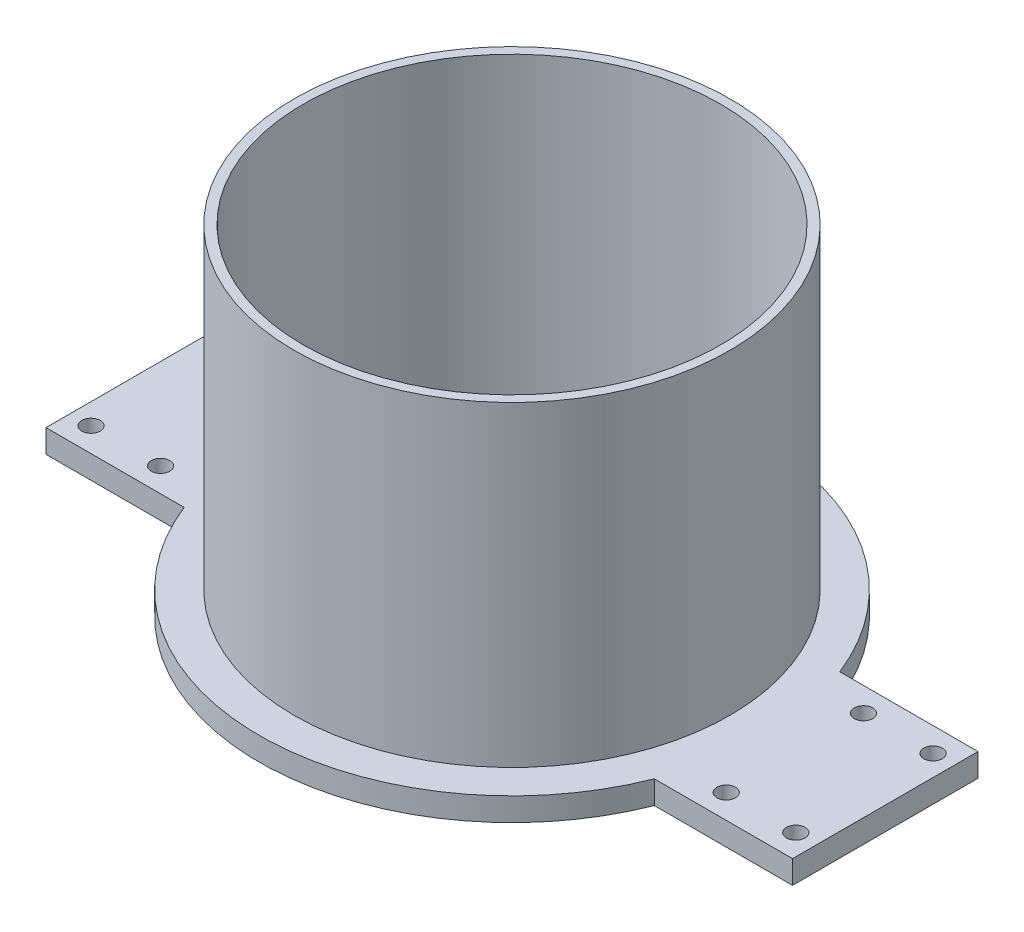
ISO-10303-21;
HEADER;
FILE_DESCRIPTION(('STEP AP214'),'2;1');
FILE_NAME('part.step','',(''),(''),'','','');
FILE_SCHEMA(('AUTOMOTIVE_DESIGN { 1 0 10303 214 1 1 1 1 }'));
ENDSEC;
DATA;
#1=APPLICATION_CONTEXT('core data for automotive mechanical design processes');
#2=APPLICATION_PROTOCOL_DEFINITION('international standard','automotive_design',2000,#1);
#3=PRODUCT_CONTEXT('',#1,'mechanical');
#4=PRODUCT('Part','Part','',(#3));
#5=PRODUCT_RELATED_PRODUCT_CATEGORY('part','',(#4));
#6=PRODUCT_DEFINITION_FORMATION('','',#4);
#7=PRODUCT_DEFINITION_CONTEXT('part definition',#1,'design');
#8=PRODUCT_DEFINITION('design','',#6,#7);
#9=PRODUCT_DEFINITION_SHAPE('','',#8);
#10=(LENGTH_UNIT() NAMED_UNIT(*) SI_UNIT(.MILLI.,.METRE.));
#11=(NAMED_UNIT(*) PLANE_ANGLE_UNIT() SI_UNIT($,.RADIAN.));
#12=(NAMED_UNIT(*) SI_UNIT($,.STERADIAN.) SOLID_ANGLE_UNIT());
#13=UNCERTAINTY_MEASURE_WITH_UNIT(LENGTH_MEASURE(1.E-05),#10,'distance_accuracy_value','');
#14=(GEOMETRIC_REPRESENTATION_CONTEXT(3) GLOBAL_UNCERTAINTY_ASSIGNED_CONTEXT((#13)) GLOBAL_UNIT_ASSIGNED_CONTEXT((#10,
#11,#12)) REPRESENTATION_CONTEXT('',''));
#15=CARTESIAN_POINT('',(0.,0.,0.));
#16=DIRECTION('',(0.,0.,1.));
#17=DIRECTION('',(1.,0.,0.));
#18=AXIS2_PLACEMENT_3D('',#15,#16,#17);
#19=CARTESIAN_POINT('',(0.,5.,0.));
#20=DIRECTION('',(0.,1.,0.));
#21=DIRECTION('',(0.,0.,1.));
#22=AXIS2_PLACEMENT_3D('',#19,#20,#21);
#23=PLANE('',#22);
#24=CARTESIAN_POINT('',(-61.,5.,14.8));
#25=DIRECTION('',(0.,1.,0.));
#26=DIRECTION('',(0.,0.,-1.));
#27=AXIS2_PLACEMENT_3D('',#24,#25,#26);
#28=CIRCLE('',#27,2.);
#29=CARTESIAN_POINT('',(-61.,5.,12.8));
#30=VERTEX_POINT('',#29);
#31=EDGE_CURVE('E228',#30,#30,#28,.T.);
#32=ORIENTED_EDGE('',*,*,#31,.F.);
#33=EDGE_LOOP('',(#32));
#34=FACE_BOUND('',#33,.T.);
#35=CARTESIAN_POINT('',(-76.,5.,-14.8));
#36=DIRECTION('',(0.,1.,0.));
#37=DIRECTION('',(0.,0.,1.));
#38=AXIS2_PLACEMENT_3D('',#35,#36,#37);
#39=CIRCLE('',#38,2.);
#40=CARTESIAN_POINT('',(-76.,5.,-12.8));
#41=VERTEX_POINT('',#40);
#42=EDGE_CURVE('E216',#41,#41,#39,.T.);
#43=ORIENTED_EDGE('',*,*,#42,.F.);
#44=EDGE_LOOP('',(#43));
#45=FACE_BOUND('',#44,.T.);
#46=CARTESIAN_POINT('',(61.,5.,-14.8));
#47=DIRECTION('',(0.,1.,0.));
#48=DIRECTION('',(0.,0.,-1.));
#49=AXIS2_PLACEMENT_3D('',#46,#47,#48);
#50=CIRCLE('',#49,2.);
#51=CARTESIAN_POINT('',(61.,5.,-16.8));
#52=VERTEX_POINT('',#51);
#53=EDGE_CURVE('E204',#52,#52,#50,.T.);
#54=ORIENTED_EDGE('',*,*,#53,.F.);
#55=EDGE_LOOP('',(#54));
#56=FACE_BOUND('',#55,.T.);
#57=CARTESIAN_POINT('',(76.0000000000002,5.,14.8000000000001));
#58=DIRECTION('',(0.,1.,0.));
#59=DIRECTION('',(0.,0.,1.));
#60=AXIS2_PLACEMENT_3D('',#57,#58,#59);
#61=CIRCLE('',#60,2.00000000000001);
#62=CARTESIAN_POINT('',(76.0000000000002,5.,16.8000000000001));
#63=VERTEX_POINT('',#62);
#64=EDGE_CURVE('E192',#63,#63,#61,.T.);
#65=ORIENTED_EDGE('',*,*,#64,.F.);
#66=EDGE_LOOP('',(#65));
#67=FACE_BOUND('',#66,.T.);
#68=CARTESIAN_POINT('',(0.,5.,0.));
#69=DIRECTION('',(0.,1.,0.));
#70=DIRECTION('',(0.,0.,1.));
#71=AXIS2_PLACEMENT_3D('',#68,#69,#70);
#72=CIRCLE('',#71,54.5);
#73=CARTESIAN_POINT('',(50.6976330808451,5.,-20.));
#74=VERTEX_POINT('',#73);
#75=CARTESIAN_POINT('',(-50.6976330808451,5.,-20.));
#76=VERTEX_POINT('',#75);
#77=EDGE_CURVE('E152',#74,#76,#72,.T.);
#78=ORIENTED_EDGE('',*,*,#77,.T.);
#79=DIRECTION('',(-1.,0.,0.));
#80=VECTOR('',#79,1.);
#81=CARTESIAN_POINT('',(-50.6976330808451,5.,-20.));
#82=LINE('',#81,#80);
#83=CARTESIAN_POINT('',(-80.5,5.,-20.));
#84=VERTEX_POINT('',#83);
#85=EDGE_CURVE('E100',#76,#84,#82,.T.);
#86=ORIENTED_EDGE('',*,*,#85,.T.);
#87=DIRECTION('',(0.,0.,1.));
#88=VECTOR('',#87,1.);
#89=CARTESIAN_POINT('',(-80.5,5.,-20.));
#90=LINE('',#89,#88);
#91=CARTESIAN_POINT('',(-80.5,5.,20.));
#92=VERTEX_POINT('',#91);
#93=EDGE_CURVE('E167',#84,#92,#90,.T.);
#94=ORIENTED_EDGE('',*,*,#93,.T.);
#95=DIRECTION('',(1.,0.,0.));
#96=VECTOR('',#95,1.);
#97=CARTESIAN_POINT('',(-80.5,5.,20.));
#98=LINE('',#97,#96);
#99=CARTESIAN_POINT('',(-50.6976330808451,5.,19.9999999999999));
#100=VERTEX_POINT('',#99);
#101=EDGE_CURVE('E180',#92,#100,#98,.T.);
#102=ORIENTED_EDGE('',*,*,#101,.T.);
#103=CARTESIAN_POINT('',(0.,5.,0.));
#104=DIRECTION('',(0.,1.,0.));
#105=DIRECTION('',(0.,0.,1.));
#106=AXIS2_PLACEMENT_3D('',#103,#104,#105);
#107=CIRCLE('',#106,54.5);
#108=CARTESIAN_POINT('',(50.6976330808451,5.,20.));
#109=VERTEX_POINT('',#108);
#110=EDGE_CURVE('E119',#100,#109,#107,.T.);
#111=ORIENTED_EDGE('',*,*,#110,.T.);
#112=DIRECTION('',(1.,0.,0.));
#113=VECTOR('',#112,1.);
#114=CARTESIAN_POINT('',(80.5,5.,20.));
#115=LINE('',#114,#113);
#116=CARTESIAN_POINT('',(80.5,5.,20.));
#117=VERTEX_POINT('',#116);
#118=EDGE_CURVE('E113',#109,#117,#115,.T.);
#119=ORIENTED_EDGE('',*,*,#118,.T.);
#120=DIRECTION('',(0.,0.,-1.));
#121=VECTOR('',#120,1.);
#122=CARTESIAN_POINT('',(80.5,5.,-20.));
#123=LINE('',#122,#121);
#124=CARTESIAN_POINT('',(80.5,5.,-20.));
#125=VERTEX_POINT('',#124);
#126=EDGE_CURVE('E117',#117,#125,#123,.T.);
#127=ORIENTED_EDGE('',*,*,#126,.T.);
#128=DIRECTION('',(-1.,0.,0.));
#129=VECTOR('',#128,1.);
#130=CARTESIAN_POINT('',(50.6976330808451,5.,-20.));
#131=LINE('',#130,#129);
#132=EDGE_CURVE('E57',#125,#74,#131,.T.);
#133=ORIENTED_EDGE('',*,*,#132,.T.);
#134=EDGE_LOOP('',(#78,#86,#94,#102,#111,#119,#127,#133));
#135=FACE_BOUND('',#134,.T.);
#136=CARTESIAN_POINT('',(61.,5.,14.8));
#137=DIRECTION('',(0.,1.,0.));
#138=DIRECTION('',(0.,0.,1.));
#139=AXIS2_PLACEMENT_3D('',#136,#137,#138);
#140=CIRCLE('',#139,2.);
#141=CARTESIAN_POINT('',(61.,5.,16.8));
#142=VERTEX_POINT('',#141);
#143=EDGE_CURVE('E188',#142,#142,#140,.T.);
#144=ORIENTED_EDGE('',*,*,#143,.F.);
#145=EDGE_LOOP('',(#144));
#146=FACE_BOUND('',#145,.T.);
#147=CARTESIAN_POINT('',(76.,5.,-14.8));
#148=DIRECTION('',(0.,1.,0.));
#149=DIRECTION('',(0.,0.,-1.));
#150=AXIS2_PLACEMENT_3D('',#147,#148,#149);
#151=CIRCLE('',#150,2.);
#152=CARTESIAN_POINT('',(76.,5.,-16.8));
#153=VERTEX_POINT('',#152);
#154=EDGE_CURVE('E198',#153,#153,#151,.T.);
#155=ORIENTED_EDGE('',*,*,#154,.F.);
#156=EDGE_LOOP('',(#155));
#157=FACE_BOUND('',#156,.T.);
#158=CARTESIAN_POINT('',(-61.,5.,-14.8));
#159=DIRECTION('',(0.,1.,0.));
#160=DIRECTION('',(0.,0.,1.));
#161=AXIS2_PLACEMENT_3D('',#158,#159,#160);
#162=CIRCLE('',#161,2.);
#163=CARTESIAN_POINT('',(-61.,5.,-12.8));
#164=VERTEX_POINT('',#163);
#165=EDGE_CURVE('E210',#164,#164,#162,.T.);
#166=ORIENTED_EDGE('',*,*,#165,.F.);
#167=EDGE_LOOP('',(#166));
#168=FACE_BOUND('',#167,.T.);
#169=CARTESIAN_POINT('',(-76.0000000000002,5.,14.8000000000001));
#170=DIRECTION('',(0.,1.,0.));
#171=DIRECTION('',(0.,0.,-1.));
#172=AXIS2_PLACEMENT_3D('',#169,#170,#171);
#173=CIRCLE('',#172,2.00000000000001);
#174=CARTESIAN_POINT('',(-76.0000000000002,5.,12.8000000000001));
#175=VERTEX_POINT('',#174);
#176=EDGE_CURVE('E222',#175,#175,#173,.T.);
#177=ORIENTED_EDGE('',*,*,#176,.F.);
#178=EDGE_LOOP('',(#177));
#179=FACE_BOUND('',#178,.T.);
#180=CARTESIAN_POINT('',(0.,5.,0.));
#181=DIRECTION('',(0.,1.,0.));
#182=DIRECTION('',(0.,0.,1.));
#183=AXIS2_PLACEMENT_3D('',#180,#181,#182);
#184=CIRCLE('',#183,47.);
#185=CARTESIAN_POINT('',(0.,5.,47.));
#186=VERTEX_POINT('',#185);
#187=EDGE_CURVE('E237',#186,#186,#184,.T.);
#188=ORIENTED_EDGE('',*,*,#187,.F.);
#189=EDGE_LOOP('',(#188));
#190=FACE_BOUND('',#189,.T.);
#191=ADVANCED_FACE('F40',(#34,#45,#56,#67,#135,#146,#157,#168,#179,#190),#23,.T.);
#192=CARTESIAN_POINT('',(0.,0.,0.));
#193=DIRECTION('',(0.,1.,0.));
#194=DIRECTION('',(0.,0.,1.));
#195=AXIS2_PLACEMENT_3D('',#192,#193,#194);
#196=PLANE('',#195);
#197=CARTESIAN_POINT('',(0.,0.,0.));
#198=DIRECTION('',(0.,1.,0.));
#199=DIRECTION('',(0.,0.,1.));
#200=AXIS2_PLACEMENT_3D('',#197,#198,#199);
#201=CIRCLE('',#200,54.5);
#202=CARTESIAN_POINT('',(50.6976330808451,0.,-20.));
#203=VERTEX_POINT('',#202);
#204=CARTESIAN_POINT('',(-50.6976330808451,0.,-20.));
#205=VERTEX_POINT('',#204);
#206=EDGE_CURVE('E137',#203,#205,#201,.T.);
#207=ORIENTED_EDGE('',*,*,#206,.F.);
#208=DIRECTION('',(-1.,0.,0.));
#209=VECTOR('',#208,1.);
#210=CARTESIAN_POINT('',(50.6976330808451,0.,-20.));
#211=LINE('',#210,#209);
#212=CARTESIAN_POINT('',(80.5,0.,-20.));
#213=VERTEX_POINT('',#212);
#214=EDGE_CURVE('E92',#213,#203,#211,.T.);
#215=ORIENTED_EDGE('',*,*,#214,.F.);
#216=DIRECTION('',(0.,0.,-1.));
#217=VECTOR('',#216,1.);
#218=CARTESIAN_POINT('',(80.5,0.,-20.));
#219=LINE('',#218,#217);
#220=CARTESIAN_POINT('',(80.5,0.,20.));
#221=VERTEX_POINT('',#220);
#222=EDGE_CURVE('E86',#221,#213,#219,.T.);
#223=ORIENTED_EDGE('',*,*,#222,.F.);
#224=DIRECTION('',(1.,0.,0.));
#225=VECTOR('',#224,1.);
#226=CARTESIAN_POINT('',(80.5,0.,20.));
#227=LINE('',#226,#225);
#228=CARTESIAN_POINT('',(50.6976330808451,0.,20.));
#229=VERTEX_POINT('',#228);
#230=EDGE_CURVE('E127',#229,#221,#227,.T.);
#231=ORIENTED_EDGE('',*,*,#230,.F.);
#232=CARTESIAN_POINT('',(0.,0.,0.));
#233=DIRECTION('',(0.,1.,0.));
#234=DIRECTION('',(0.,0.,1.));
#235=AXIS2_PLACEMENT_3D('',#232,#233,#234);
#236=CIRCLE('',#235,54.5);
#237=CARTESIAN_POINT('',(-50.6976330808451,0.,19.9999999999999));
#238=VERTEX_POINT('',#237);
#239=EDGE_CURVE('E147',#238,#229,#236,.T.);
#240=ORIENTED_EDGE('',*,*,#239,.F.);
#241=DIRECTION('',(1.,0.,0.));
#242=VECTOR('',#241,1.);
#243=CARTESIAN_POINT('',(-80.5,0.,20.));
#244=LINE('',#243,#242);
#245=CARTESIAN_POINT('',(-80.5,0.,20.));
#246=VERTEX_POINT('',#245);
#247=EDGE_CURVE('E145',#246,#238,#244,.T.);
#248=ORIENTED_EDGE('',*,*,#247,.F.);
#249=DIRECTION('',(0.,0.,1.));
#250=VECTOR('',#249,1.);
#251=CARTESIAN_POINT('',(-80.5,0.,-20.));
#252=LINE('',#251,#250);
#253=CARTESIAN_POINT('',(-80.5,0.,-20.));
#254=VERTEX_POINT('',#253);
#255=EDGE_CURVE('E143',#254,#246,#252,.T.);
#256=ORIENTED_EDGE('',*,*,#255,.F.);
#257=DIRECTION('',(-1.,0.,0.));
#258=VECTOR('',#257,1.);
#259=CARTESIAN_POINT('',(-50.6976330808451,0.,-20.));
#260=LINE('',#259,#258);
#261=EDGE_CURVE('E140',#205,#254,#260,.T.);
#262=ORIENTED_EDGE('',*,*,#261,.F.);
#263=EDGE_LOOP('',(#207,#215,#223,#231,#240,#248,#256,#262));
#264=FACE_BOUND('',#263,.T.);
#265=CARTESIAN_POINT('',(0.,0.,0.));
#266=DIRECTION('',(0.,1.,0.));
#267=DIRECTION('',(0.,0.,1.));
#268=AXIS2_PLACEMENT_3D('',#265,#266,#267);
#269=CIRCLE('',#268,45.);
#270=CARTESIAN_POINT('',(0.,0.,45.));
#271=VERTEX_POINT('',#270);
#272=EDGE_CURVE('E141',#271,#271,#269,.T.);
#273=ORIENTED_EDGE('',*,*,#272,.T.);
#274=EDGE_LOOP('',(#273));
#275=FACE_BOUND('',#274,.T.);
#276=CARTESIAN_POINT('',(61.,0.,14.8));
#277=DIRECTION('',(0.,1.,0.));
#278=DIRECTION('',(0.,0.,1.));
#279=AXIS2_PLACEMENT_3D('',#276,#277,#278);
#280=CIRCLE('',#279,2.);
#281=CARTESIAN_POINT('',(61.,0.,16.8));
#282=VERTEX_POINT('',#281);
#283=EDGE_CURVE('E189',#282,#282,#280,.T.);
#284=ORIENTED_EDGE('',*,*,#283,.T.);
#285=EDGE_LOOP('',(#284));
#286=FACE_BOUND('',#285,.T.);
#287=CARTESIAN_POINT('',(76.0000000000002,0.,14.8000000000001));
#288=DIRECTION('',(0.,1.,0.));
#289=DIRECTION('',(0.,0.,1.));
#290=AXIS2_PLACEMENT_3D('',#287,#288,#289);
#291=CIRCLE('',#290,2.00000000000001);
#292=CARTESIAN_POINT('',(76.0000000000002,0.,16.8000000000001));
#293=VERTEX_POINT('',#292);
#294=EDGE_CURVE('E195',#293,#293,#291,.T.);
#295=ORIENTED_EDGE('',*,*,#294,.T.);
#296=EDGE_LOOP('',(#295));
#297=FACE_BOUND('',#296,.T.);
#298=CARTESIAN_POINT('',(76.,0.,-14.8));
#299=DIRECTION('',(0.,1.,0.));
#300=DIRECTION('',(0.,0.,-1.));
#301=AXIS2_PLACEMENT_3D('',#298,#299,#300);
#302=CIRCLE('',#301,2.);
#303=CARTESIAN_POINT('',(76.,0.,-16.8));
#304=VERTEX_POINT('',#303);
#305=EDGE_CURVE('E201',#304,#304,#302,.T.);
#306=ORIENTED_EDGE('',*,*,#305,.T.);
#307=EDGE_LOOP('',(#306));
#308=FACE_BOUND('',#307,.T.);
#309=CARTESIAN_POINT('',(61.,0.,-14.8));
#310=DIRECTION('',(0.,1.,0.));
#311=DIRECTION('',(0.,0.,-1.));
#312=AXIS2_PLACEMENT_3D('',#309,#310,#311);
#313=CIRCLE('',#312,2.);
#314=CARTESIAN_POINT('',(61.,0.,-16.8));
#315=VERTEX_POINT('',#314);
#316=EDGE_CURVE('E207',#315,#315,#313,.T.);
#317=ORIENTED_EDGE('',*,*,#316,.T.);
#318=EDGE_LOOP('',(#317));
#319=FACE_BOUND('',#318,.T.);
#320=CARTESIAN_POINT('',(-61.,0.,-14.8));
#321=DIRECTION('',(0.,1.,0.));
#322=DIRECTION('',(0.,0.,1.));
#323=AXIS2_PLACEMENT_3D('',#320,#321,#322);
#324=CIRCLE('',#323,2.);
#325=CARTESIAN_POINT('',(-61.,0.,-12.8));
#326=VERTEX_POINT('',#325);
#327=EDGE_CURVE('E213',#326,#326,#324,.T.);
#328=ORIENTED_EDGE('',*,*,#327,.T.);
#329=EDGE_LOOP('',(#328));
#330=FACE_BOUND('',#329,.T.);
#331=CARTESIAN_POINT('',(-76.,0.,-14.8));
#332=DIRECTION('',(0.,1.,0.));
#333=DIRECTION('',(0.,0.,1.));
#334=AXIS2_PLACEMENT_3D('',#331,#332,#333);
#335=CIRCLE('',#334,2.);
#336=CARTESIAN_POINT('',(-76.,0.,-12.8));
#337=VERTEX_POINT('',#336);
#338=EDGE_CURVE('E219',#337,#337,#335,.T.);
#339=ORIENTED_EDGE('',*,*,#338,.T.);
#340=EDGE_LOOP('',(#339));
#341=FACE_BOUND('',#340,.T.);
#342=CARTESIAN_POINT('',(-76.0000000000002,0.,14.8000000000001));
#343=DIRECTION('',(0.,1.,0.));
#344=DIRECTION('',(0.,0.,-1.));
#345=AXIS2_PLACEMENT_3D('',#342,#343,#344);
#346=CIRCLE('',#345,2.00000000000001);
#347=CARTESIAN_POINT('',(-76.0000000000002,0.,12.8000000000001));
#348=VERTEX_POINT('',#347);
#349=EDGE_CURVE('E225',#348,#348,#346,.T.);
#350=ORIENTED_EDGE('',*,*,#349,.T.);
#351=EDGE_LOOP('',(#350));
#352=FACE_BOUND('',#351,.T.);
#353=CARTESIAN_POINT('',(-61.,0.,14.8));
#354=DIRECTION('',(0.,1.,0.));
#355=DIRECTION('',(0.,0.,-1.));
#356=AXIS2_PLACEMENT_3D('',#353,#354,#355);
#357=CIRCLE('',#356,2.);
#358=CARTESIAN_POINT('',(-61.,0.,12.8));
#359=VERTEX_POINT('',#358);
#360=EDGE_CURVE('E231',#359,#359,#357,.T.);
#361=ORIENTED_EDGE('',*,*,#360,.T.);
#362=EDGE_LOOP('',(#361));
#363=FACE_BOUND('',#362,.T.);
#364=ADVANCED_FACE('F171',(#264,#275,#286,#297,#308,#319,#330,#341,#352,#363),#196,.F.);
#365=CARTESIAN_POINT('',(0.,5.,0.));
#366=DIRECTION('',(0.,-1.,0.));
#367=DIRECTION('',(0.,0.,-1.));
#368=AXIS2_PLACEMENT_3D('',#365,#366,#367);
#369=CYLINDRICAL_SURFACE('',#368,54.5);
#370=ORIENTED_EDGE('',*,*,#206,.T.);
#371=DIRECTION('',(0.,-1.,0.));
#372=VECTOR('',#371,1.);
#373=CARTESIAN_POINT('',(-50.6976330808451,5.,-20.));
#374=LINE('',#373,#372);
#375=EDGE_CURVE('E11',#76,#205,#374,.T.);
#376=ORIENTED_EDGE('',*,*,#375,.F.);
#377=ORIENTED_EDGE('',*,*,#77,.F.);
#378=DIRECTION('',(0.,-1.,0.));
#379=VECTOR('',#378,1.);
#380=CARTESIAN_POINT('',(50.6976330808451,5.,-20.));
#381=LINE('',#380,#379);
#382=EDGE_CURVE('E133',#74,#203,#381,.T.);
#383=ORIENTED_EDGE('',*,*,#382,.T.);
#384=EDGE_LOOP('',(#370,#376,#377,#383));
#385=FACE_BOUND('',#384,.T.);
#386=ADVANCED_FACE('F42',(#385),#369,.T.);
#387=CARTESIAN_POINT('',(-50.6976330808451,5.,-20.));
#388=DIRECTION('',(0.,0.,1.));
#389=DIRECTION('',(1.,0.,0.));
#390=AXIS2_PLACEMENT_3D('',#387,#388,#389);
#391=PLANE('',#390);
#392=ORIENTED_EDGE('',*,*,#261,.T.);
#393=DIRECTION('',(0.,-1.,0.));
#394=VECTOR('',#393,1.);
#395=CARTESIAN_POINT('',(-80.5,5.,-20.));
#396=LINE('',#395,#394);
#397=EDGE_CURVE('E49',#84,#254,#396,.T.);
#398=ORIENTED_EDGE('',*,*,#397,.F.);
#399=ORIENTED_EDGE('',*,*,#85,.F.);
#400=ORIENTED_EDGE('',*,*,#375,.T.);
#401=EDGE_LOOP('',(#392,#398,#399,#400));
#402=FACE_BOUND('',#401,.T.);
#403=ADVANCED_FACE('F287',(#402),#391,.F.);
#404=CARTESIAN_POINT('',(-80.5,5.,-20.));
#405=DIRECTION('',(1.,0.,0.));
#406=DIRECTION('',(0.,0.,-1.));
#407=AXIS2_PLACEMENT_3D('',#404,#405,#406);
#408=PLANE('',#407);
#409=ORIENTED_EDGE('',*,*,#255,.T.);
#410=DIRECTION('',(0.,-1.,0.));
#411=VECTOR('',#410,1.);
#412=CARTESIAN_POINT('',(-80.5,5.,20.));
#413=LINE('',#412,#411);
#414=EDGE_CURVE('E159',#92,#246,#413,.T.);
#415=ORIENTED_EDGE('',*,*,#414,.F.);
#416=ORIENTED_EDGE('',*,*,#93,.F.);
#417=ORIENTED_EDGE('',*,*,#397,.T.);
#418=EDGE_LOOP('',(#409,#415,#416,#417));
#419=FACE_BOUND('',#418,.T.);
#420=ADVANCED_FACE('F165',(#419),#408,.F.);
#421=CARTESIAN_POINT('',(-80.5,5.,20.));
#422=DIRECTION('',(0.,0.,-1.));
#423=DIRECTION('',(-1.,0.,0.));
#424=AXIS2_PLACEMENT_3D('',#421,#422,#423);
#425=PLANE('',#424);
#426=ORIENTED_EDGE('',*,*,#247,.T.);
#427=DIRECTION('',(0.,-1.,0.));
#428=VECTOR('',#427,1.);
#429=CARTESIAN_POINT('',(-50.6976330808451,5.,19.9999999999999));
#430=LINE('',#429,#428);
#431=EDGE_CURVE('E156',#100,#238,#430,.T.);
#432=ORIENTED_EDGE('',*,*,#431,.F.);
#433=ORIENTED_EDGE('',*,*,#101,.F.);
#434=ORIENTED_EDGE('',*,*,#414,.T.);
#435=EDGE_LOOP('',(#426,#432,#433,#434));
#436=FACE_BOUND('',#435,.T.);
#437=ADVANCED_FACE('F176',(#436),#425,.F.);
#438=CARTESIAN_POINT('',(0.,5.,0.));
#439=DIRECTION('',(0.,-1.,0.));
#440=DIRECTION('',(0.,0.,-1.));
#441=AXIS2_PLACEMENT_3D('',#438,#439,#440);
#442=CYLINDRICAL_SURFACE('',#441,54.5);
#443=ORIENTED_EDGE('',*,*,#239,.T.);
#444=DIRECTION('',(0.,-1.,0.));
#445=VECTOR('',#444,1.);
#446=CARTESIAN_POINT('',(50.6976330808451,5.,20.));
#447=LINE('',#446,#445);
#448=EDGE_CURVE('E128',#109,#229,#447,.T.);
#449=ORIENTED_EDGE('',*,*,#448,.F.);
#450=ORIENTED_EDGE('',*,*,#110,.F.);
#451=ORIENTED_EDGE('',*,*,#431,.T.);
#452=EDGE_LOOP('',(#443,#449,#450,#451));
#453=FACE_BOUND('',#452,.T.);
#454=ADVANCED_FACE('F179',(#453),#442,.T.);
#455=CARTESIAN_POINT('',(80.5,5.,20.));
#456=DIRECTION('',(0.,0.,-1.));
#457=DIRECTION('',(-1.,0.,0.));
#458=AXIS2_PLACEMENT_3D('',#455,#456,#457);
#459=PLANE('',#458);
#460=ORIENTED_EDGE('',*,*,#230,.T.);
#461=DIRECTION('',(0.,-1.,0.));
#462=VECTOR('',#461,1.);
#463=CARTESIAN_POINT('',(80.5,5.,20.));
#464=LINE('',#463,#462);
#465=EDGE_CURVE('E124',#117,#221,#464,.T.);
#466=ORIENTED_EDGE('',*,*,#465,.F.);
#467=ORIENTED_EDGE('',*,*,#118,.F.);
#468=ORIENTED_EDGE('',*,*,#448,.T.);
#469=EDGE_LOOP('',(#460,#466,#467,#468));
#470=FACE_BOUND('',#469,.T.);
#471=ADVANCED_FACE('F125',(#470),#459,.F.);
#472=CARTESIAN_POINT('',(80.5,5.,-20.));
#473=DIRECTION('',(-1.,0.,0.));
#474=DIRECTION('',(0.,0.,1.));
#475=AXIS2_PLACEMENT_3D('',#472,#473,#474);
#476=PLANE('',#475);
#477=ORIENTED_EDGE('',*,*,#222,.T.);
#478=DIRECTION('',(0.,-1.,0.));
#479=VECTOR('',#478,1.);
#480=CARTESIAN_POINT('',(80.5,5.,-20.));
#481=LINE('',#480,#479);
#482=EDGE_CURVE('E129',#125,#213,#481,.T.);
#483=ORIENTED_EDGE('',*,*,#482,.F.);
#484=ORIENTED_EDGE('',*,*,#126,.F.);
#485=ORIENTED_EDGE('',*,*,#465,.T.);
#486=EDGE_LOOP('',(#477,#483,#484,#485));
#487=FACE_BOUND('',#486,.T.);
#488=ADVANCED_FACE('F131',(#487),#476,.F.);
#489=CARTESIAN_POINT('',(50.6976330808451,5.,-20.));
#490=DIRECTION('',(0.,0.,1.));
#491=DIRECTION('',(1.,0.,0.));
#492=AXIS2_PLACEMENT_3D('',#489,#490,#491);
#493=PLANE('',#492);
#494=ORIENTED_EDGE('',*,*,#214,.T.);
#495=ORIENTED_EDGE('',*,*,#382,.F.);
#496=ORIENTED_EDGE('',*,*,#132,.F.);
#497=ORIENTED_EDGE('',*,*,#482,.T.);
#498=EDGE_LOOP('',(#494,#495,#496,#497));
#499=FACE_BOUND('',#498,.T.);
#500=ADVANCED_FACE('F275',(#499),#493,.F.);
#501=CARTESIAN_POINT('',(0.,5.,0.));
#502=DIRECTION('',(0.,-1.,0.));
#503=DIRECTION('',(0.,0.,-1.));
#504=AXIS2_PLACEMENT_3D('',#501,#502,#503);
#505=CYLINDRICAL_SURFACE('',#504,45.);
#506=ORIENTED_EDGE('',*,*,#272,.F.);
#507=EDGE_LOOP('',(#506));
#508=FACE_BOUND('',#507,.T.);
#509=CARTESIAN_POINT('',(0.,73.18,0.));
#510=DIRECTION('',(0.,1.,0.));
#511=DIRECTION('',(0.,0.,1.));
#512=AXIS2_PLACEMENT_3D('',#509,#510,#511);
#513=CIRCLE('',#512,45.);
#514=CARTESIAN_POINT('',(0.,73.18,45.));
#515=VERTEX_POINT('',#514);
#516=EDGE_CURVE('E240',#515,#515,#513,.T.);
#517=ORIENTED_EDGE('',*,*,#516,.T.);
#518=EDGE_LOOP('',(#517));
#519=FACE_BOUND('',#518,.T.);
#520=ADVANCED_FACE('F246',(#508,#519),#505,.F.);
#521=CARTESIAN_POINT('',(61.,5.,14.8));
#522=DIRECTION('',(0.,-1.,0.));
#523=DIRECTION('',(0.,0.,-1.));
#524=AXIS2_PLACEMENT_3D('',#521,#522,#523);
#525=CYLINDRICAL_SURFACE('',#524,2.);
#526=ORIENTED_EDGE('',*,*,#143,.T.);
#527=EDGE_LOOP('',(#526));
#528=FACE_BOUND('',#527,.T.);
#529=ORIENTED_EDGE('',*,*,#283,.F.);
#530=EDGE_LOOP('',(#529));
#531=FACE_BOUND('',#530,.T.);
#532=ADVANCED_FACE('F348',(#528,#531),#525,.F.);
#533=CARTESIAN_POINT('',(76.0000000000002,5.,14.8000000000001));
#534=DIRECTION('',(0.,-1.,0.));
#535=DIRECTION('',(0.,0.,-1.));
#536=AXIS2_PLACEMENT_3D('',#533,#534,#535);
#537=CYLINDRICAL_SURFACE('',#536,2.00000000000001);
#538=ORIENTED_EDGE('',*,*,#64,.T.);
#539=EDGE_LOOP('',(#538));
#540=FACE_BOUND('',#539,.T.);
#541=ORIENTED_EDGE('',*,*,#294,.F.);
#542=EDGE_LOOP('',(#541));
#543=FACE_BOUND('',#542,.T.);
#544=ADVANCED_FACE('F359',(#540,#543),#537,.F.);
#545=CARTESIAN_POINT('',(76.,5.,-14.8));
#546=DIRECTION('',(0.,-1.,0.));
#547=DIRECTION('',(0.,0.,-1.));
#548=AXIS2_PLACEMENT_3D('',#545,#546,#547);
#549=CYLINDRICAL_SURFACE('',#548,2.);
#550=ORIENTED_EDGE('',*,*,#154,.T.);
#551=EDGE_LOOP('',(#550));
#552=FACE_BOUND('',#551,.T.);
#553=ORIENTED_EDGE('',*,*,#305,.F.);
#554=EDGE_LOOP('',(#553));
#555=FACE_BOUND('',#554,.T.);
#556=ADVANCED_FACE('F367',(#552,#555),#549,.F.);
#557=CARTESIAN_POINT('',(61.,5.,-14.8));
#558=DIRECTION('',(0.,-1.,0.));
#559=DIRECTION('',(0.,0.,-1.));
#560=AXIS2_PLACEMENT_3D('',#557,#558,#559);
#561=CYLINDRICAL_SURFACE('',#560,2.);
#562=ORIENTED_EDGE('',*,*,#53,.T.);
#563=EDGE_LOOP('',(#562));
#564=FACE_BOUND('',#563,.T.);
#565=ORIENTED_EDGE('',*,*,#316,.F.);
#566=EDGE_LOOP('',(#565));
#567=FACE_BOUND('',#566,.T.);
#568=ADVANCED_FACE('F376',(#564,#567),#561,.F.);
#569=CARTESIAN_POINT('',(-61.,5.,-14.8));
#570=DIRECTION('',(0.,-1.,0.));
#571=DIRECTION('',(0.,0.,-1.));
#572=AXIS2_PLACEMENT_3D('',#569,#570,#571);
#573=CYLINDRICAL_SURFACE('',#572,2.);
#574=ORIENTED_EDGE('',*,*,#165,.T.);
#575=EDGE_LOOP('',(#574));
#576=FACE_BOUND('',#575,.T.);
#577=ORIENTED_EDGE('',*,*,#327,.F.);
#578=EDGE_LOOP('',(#577));
#579=FACE_BOUND('',#578,.T.);
#580=ADVANCED_FACE('F385',(#576,#579),#573,.F.);
#581=CARTESIAN_POINT('',(-76.,5.,-14.8));
#582=DIRECTION('',(0.,-1.,0.));
#583=DIRECTION('',(0.,0.,-1.));
#584=AXIS2_PLACEMENT_3D('',#581,#582,#583);
#585=CYLINDRICAL_SURFACE('',#584,2.);
#586=ORIENTED_EDGE('',*,*,#42,.T.);
#587=EDGE_LOOP('',(#586));
#588=FACE_BOUND('',#587,.T.);
#589=ORIENTED_EDGE('',*,*,#338,.F.);
#590=EDGE_LOOP('',(#589));
#591=FACE_BOUND('',#590,.T.);
#592=ADVANCED_FACE('F394',(#588,#591),#585,.F.);
#593=CARTESIAN_POINT('',(-76.0000000000002,5.,14.8000000000001));
#594=DIRECTION('',(0.,-1.,0.));
#595=DIRECTION('',(0.,0.,-1.));
#596=AXIS2_PLACEMENT_3D('',#593,#594,#595);
#597=CYLINDRICAL_SURFACE('',#596,2.00000000000001);
#598=ORIENTED_EDGE('',*,*,#176,.T.);
#599=EDGE_LOOP('',(#598));
#600=FACE_BOUND('',#599,.T.);
#601=ORIENTED_EDGE('',*,*,#349,.F.);
#602=EDGE_LOOP('',(#601));
#603=FACE_BOUND('',#602,.T.);
#604=ADVANCED_FACE('F260',(#600,#603),#597,.F.);
#605=CARTESIAN_POINT('',(-61.,5.,14.8));
#606=DIRECTION('',(0.,-1.,0.));
#607=DIRECTION('',(0.,0.,-1.));
#608=AXIS2_PLACEMENT_3D('',#605,#606,#607);
#609=CYLINDRICAL_SURFACE('',#608,2.);
#610=ORIENTED_EDGE('',*,*,#31,.T.);
#611=EDGE_LOOP('',(#610));
#612=FACE_BOUND('',#611,.T.);
#613=ORIENTED_EDGE('',*,*,#360,.F.);
#614=EDGE_LOOP('',(#613));
#615=FACE_BOUND('',#614,.T.);
#616=ADVANCED_FACE('F251',(#612,#615),#609,.F.);
#617=CARTESIAN_POINT('',(0.,73.18,0.));
#618=DIRECTION('',(0.,1.,0.));
#619=DIRECTION('',(0.,0.,1.));
#620=AXIS2_PLACEMENT_3D('',#617,#618,#619);
#621=PLANE('',#620);
#622=CARTESIAN_POINT('',(0.,73.18,0.));
#623=DIRECTION('',(0.,1.,0.));
#624=DIRECTION('',(0.,0.,1.));
#625=AXIS2_PLACEMENT_3D('',#622,#623,#624);
#626=CIRCLE('',#625,47.);
#627=CARTESIAN_POINT('',(0.,73.18,47.));
#628=VERTEX_POINT('',#627);
#629=EDGE_CURVE('E234',#628,#628,#626,.T.);
#630=ORIENTED_EDGE('',*,*,#629,.T.);
#631=EDGE_LOOP('',(#630));
#632=FACE_BOUND('',#631,.T.);
#633=ORIENTED_EDGE('',*,*,#516,.F.);
#634=EDGE_LOOP('',(#633));
#635=FACE_BOUND('',#634,.T.);
#636=ADVANCED_FACE('F248',(#632,#635),#621,.T.);
#637=CARTESIAN_POINT('',(0.,73.18,0.));
#638=DIRECTION('',(0.,-1.,0.));
#639=DIRECTION('',(0.,0.,-1.));
#640=AXIS2_PLACEMENT_3D('',#637,#638,#639);
#641=CYLINDRICAL_SURFACE('',#640,47.);
#642=ORIENTED_EDGE('',*,*,#629,.F.);
#643=EDGE_LOOP('',(#642));
#644=FACE_BOUND('',#643,.T.);
#645=ORIENTED_EDGE('',*,*,#187,.T.);
#646=EDGE_LOOP('',(#645));
#647=FACE_BOUND('',#646,.T.);
#648=ADVANCED_FACE('F250',(#644,#647),#641,.T.);
#649=CLOSED_SHELL('',(#191,#364,#386,#403,#420,#437,#454,#471,#488,#500,#520,#532,#544,#556,
#568,#580,#592,#604,#616,#636,#648));
#650=MANIFOLD_SOLID_BREP('B2',#649);
#651=ADVANCED_BREP_SHAPE_REPRESENTATION('',(#18,#650),#14);
#652=SHAPE_DEFINITION_REPRESENTATION(#9,#651);
ENDSEC;
END-ISO-10303-21;
